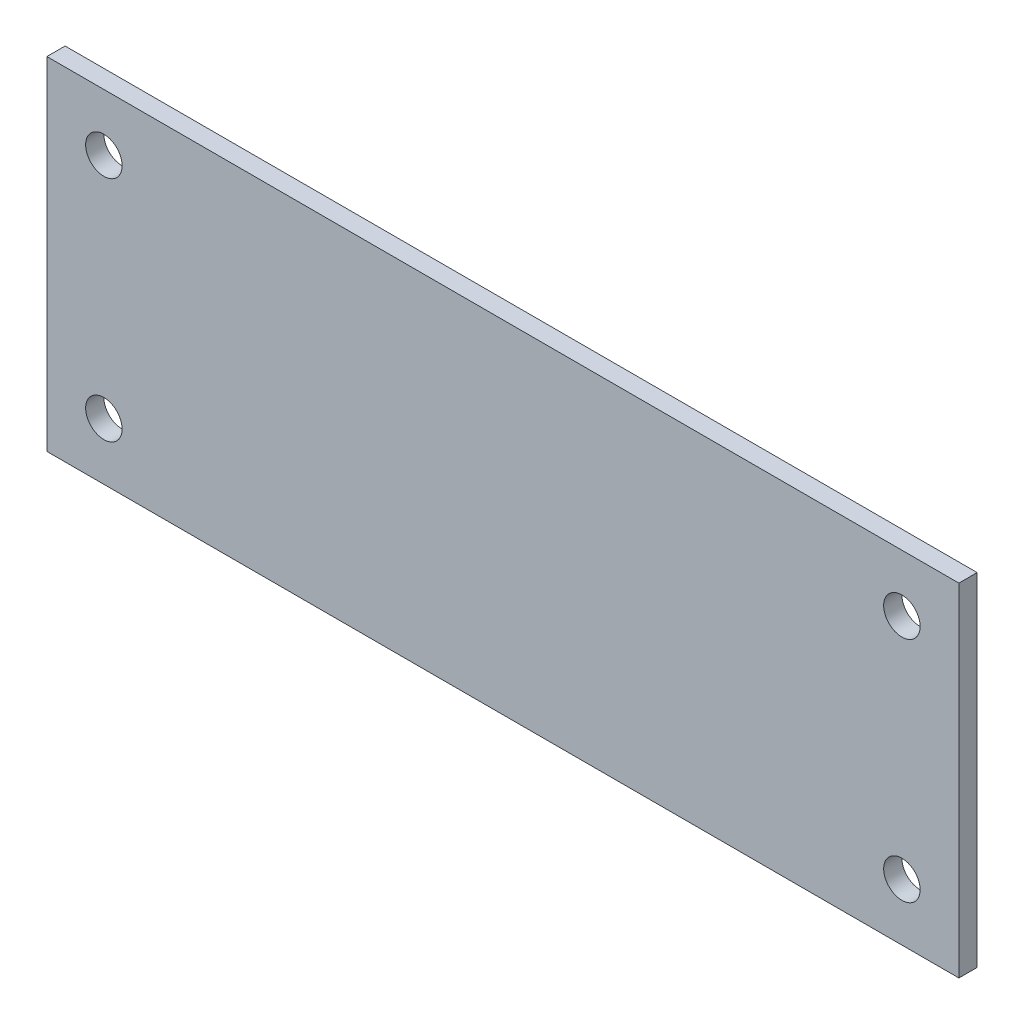
ISO-10303-21;
HEADER;
FILE_DESCRIPTION(('STEP AP214'),'2;1');
FILE_NAME('part.step','',(''),(''),'','','');
FILE_SCHEMA(('AUTOMOTIVE_DESIGN { 1 0 10303 214 1 1 1 1 }'));
ENDSEC;
DATA;
#1=APPLICATION_CONTEXT('core data for automotive mechanical design processes');
#2=APPLICATION_PROTOCOL_DEFINITION('international standard','automotive_design',2000,#1);
#3=PRODUCT_CONTEXT('',#1,'mechanical');
#4=PRODUCT('Part','Part','',(#3));
#5=PRODUCT_RELATED_PRODUCT_CATEGORY('part','',(#4));
#6=PRODUCT_DEFINITION_FORMATION('','',#4);
#7=PRODUCT_DEFINITION_CONTEXT('part definition',#1,'design');
#8=PRODUCT_DEFINITION('design','',#6,#7);
#9=PRODUCT_DEFINITION_SHAPE('','',#8);
#10=(LENGTH_UNIT() NAMED_UNIT(*) SI_UNIT(.MILLI.,.METRE.));
#11=(NAMED_UNIT(*) PLANE_ANGLE_UNIT() SI_UNIT($,.RADIAN.));
#12=(NAMED_UNIT(*) SI_UNIT($,.STERADIAN.) SOLID_ANGLE_UNIT());
#13=UNCERTAINTY_MEASURE_WITH_UNIT(LENGTH_MEASURE(1.E-05),#10,'distance_accuracy_value','');
#14=(GEOMETRIC_REPRESENTATION_CONTEXT(3) GLOBAL_UNCERTAINTY_ASSIGNED_CONTEXT((#13)) GLOBAL_UNIT_ASSIGNED_CONTEXT((#10,
#11,#12)) REPRESENTATION_CONTEXT('',''));
#15=CARTESIAN_POINT('',(0.,0.,0.));
#16=DIRECTION('',(0.,0.,1.));
#17=DIRECTION('',(1.,0.,0.));
#18=AXIS2_PLACEMENT_3D('',#15,#16,#17);
#19=CARTESIAN_POINT('',(0.,0.,1.6));
#20=DIRECTION('',(0.,0.,1.));
#21=DIRECTION('',(1.,0.,0.));
#22=AXIS2_PLACEMENT_3D('',#19,#20,#21);
#23=PLANE('',#22);
#24=CARTESIAN_POINT('',(35.,-10.,1.6));
#25=DIRECTION('',(0.,0.,1.));
#26=DIRECTION('',(1.,0.,0.));
#27=AXIS2_PLACEMENT_3D('',#24,#25,#26);
#28=CIRCLE('',#27,1.6);
#29=CARTESIAN_POINT('',(36.6,-10.,1.6));
#30=VERTEX_POINT('',#29);
#31=EDGE_CURVE('E121',#30,#30,#28,.T.);
#32=ORIENTED_EDGE('',*,*,#31,.F.);
#33=EDGE_LOOP('',(#32));
#34=FACE_BOUND('',#33,.T.);
#35=CARTESIAN_POINT('',(-35.,10.,1.6));
#36=DIRECTION('',(0.,0.,1.));
#37=DIRECTION('',(1.,0.,0.));
#38=AXIS2_PLACEMENT_3D('',#35,#36,#37);
#39=CIRCLE('',#38,1.6);
#40=CARTESIAN_POINT('',(-33.4,10.,1.6));
#41=VERTEX_POINT('',#40);
#42=EDGE_CURVE('E100',#41,#41,#39,.T.);
#43=ORIENTED_EDGE('',*,*,#42,.F.);
#44=EDGE_LOOP('',(#43));
#45=FACE_BOUND('',#44,.T.);
#46=DIRECTION('',(0.,-1.,0.));
#47=VECTOR('',#46,1.);
#48=CARTESIAN_POINT('',(-40.,15.,1.6));
#49=LINE('',#48,#47);
#50=CARTESIAN_POINT('',(-40.,15.,1.6));
#51=VERTEX_POINT('',#50);
#52=CARTESIAN_POINT('',(-40.,-15.,1.6));
#53=VERTEX_POINT('',#52);
#54=EDGE_CURVE('E85',#51,#53,#49,.T.);
#55=ORIENTED_EDGE('',*,*,#54,.T.);
#56=DIRECTION('',(1.,0.,0.));
#57=VECTOR('',#56,1.);
#58=CARTESIAN_POINT('',(-40.,-15.,1.6));
#59=LINE('',#58,#57);
#60=CARTESIAN_POINT('',(40.,-15.,1.6));
#61=VERTEX_POINT('',#60);
#62=EDGE_CURVE('E80',#53,#61,#59,.T.);
#63=ORIENTED_EDGE('',*,*,#62,.T.);
#64=DIRECTION('',(0.,1.,0.));
#65=VECTOR('',#64,1.);
#66=CARTESIAN_POINT('',(40.,15.,1.6));
#67=LINE('',#66,#65);
#68=CARTESIAN_POINT('',(40.,15.,1.6));
#69=VERTEX_POINT('',#68);
#70=EDGE_CURVE('E83',#61,#69,#67,.T.);
#71=ORIENTED_EDGE('',*,*,#70,.T.);
#72=DIRECTION('',(-1.,0.,0.));
#73=VECTOR('',#72,1.);
#74=CARTESIAN_POINT('',(-40.,15.,1.6));
#75=LINE('',#74,#73);
#76=EDGE_CURVE('E50',#69,#51,#75,.T.);
#77=ORIENTED_EDGE('',*,*,#76,.T.);
#78=EDGE_LOOP('',(#55,#63,#71,#77));
#79=FACE_BOUND('',#78,.T.);
#80=CARTESIAN_POINT('',(35.,10.,1.6));
#81=DIRECTION('',(0.,0.,1.));
#82=DIRECTION('',(1.,0.,0.));
#83=AXIS2_PLACEMENT_3D('',#80,#81,#82);
#84=CIRCLE('',#83,1.6);
#85=CARTESIAN_POINT('',(36.6,10.,1.6));
#86=VERTEX_POINT('',#85);
#87=EDGE_CURVE('E115',#86,#86,#84,.T.);
#88=ORIENTED_EDGE('',*,*,#87,.F.);
#89=EDGE_LOOP('',(#88));
#90=FACE_BOUND('',#89,.T.);
#91=CARTESIAN_POINT('',(-35.,-10.,1.6));
#92=DIRECTION('',(0.,0.,1.));
#93=DIRECTION('',(1.,0.,0.));
#94=AXIS2_PLACEMENT_3D('',#91,#92,#93);
#95=CIRCLE('',#94,1.6);
#96=CARTESIAN_POINT('',(-33.4,-10.,1.6));
#97=VERTEX_POINT('',#96);
#98=EDGE_CURVE('E127',#97,#97,#95,.T.);
#99=ORIENTED_EDGE('',*,*,#98,.F.);
#100=EDGE_LOOP('',(#99));
#101=FACE_BOUND('',#100,.T.);
#102=ADVANCED_FACE('F33',(#34,#45,#79,#90,#101),#23,.T.);
#103=CARTESIAN_POINT('',(0.,0.,0.));
#104=DIRECTION('',(0.,0.,1.));
#105=DIRECTION('',(1.,0.,0.));
#106=AXIS2_PLACEMENT_3D('',#103,#104,#105);
#107=PLANE('',#106);
#108=DIRECTION('',(0.,-1.,0.));
#109=VECTOR('',#108,1.);
#110=CARTESIAN_POINT('',(-40.,15.,0.));
#111=LINE('',#110,#109);
#112=CARTESIAN_POINT('',(-40.,15.,0.));
#113=VERTEX_POINT('',#112);
#114=CARTESIAN_POINT('',(-40.,-15.,0.));
#115=VERTEX_POINT('',#114);
#116=EDGE_CURVE('E97',#113,#115,#111,.T.);
#117=ORIENTED_EDGE('',*,*,#116,.F.);
#118=DIRECTION('',(-1.,0.,0.));
#119=VECTOR('',#118,1.);
#120=CARTESIAN_POINT('',(-40.,15.,0.));
#121=LINE('',#120,#119);
#122=CARTESIAN_POINT('',(40.,15.,0.));
#123=VERTEX_POINT('',#122);
#124=EDGE_CURVE('E73',#123,#113,#121,.T.);
#125=ORIENTED_EDGE('',*,*,#124,.F.);
#126=DIRECTION('',(0.,1.,0.));
#127=VECTOR('',#126,1.);
#128=CARTESIAN_POINT('',(40.,15.,0.));
#129=LINE('',#128,#127);
#130=CARTESIAN_POINT('',(40.,-15.,0.));
#131=VERTEX_POINT('',#130);
#132=EDGE_CURVE('E67',#131,#123,#129,.T.);
#133=ORIENTED_EDGE('',*,*,#132,.F.);
#134=DIRECTION('',(1.,0.,0.));
#135=VECTOR('',#134,1.);
#136=CARTESIAN_POINT('',(-40.,-15.,0.));
#137=LINE('',#136,#135);
#138=EDGE_CURVE('E89',#115,#131,#137,.T.);
#139=ORIENTED_EDGE('',*,*,#138,.F.);
#140=EDGE_LOOP('',(#117,#125,#133,#139));
#141=FACE_BOUND('',#140,.T.);
#142=CARTESIAN_POINT('',(-35.,10.,0.));
#143=DIRECTION('',(0.,0.,1.));
#144=DIRECTION('',(1.,0.,0.));
#145=AXIS2_PLACEMENT_3D('',#142,#143,#144);
#146=CIRCLE('',#145,1.6);
#147=CARTESIAN_POINT('',(-33.4,10.,0.));
#148=VERTEX_POINT('',#147);
#149=EDGE_CURVE('E112',#148,#148,#146,.T.);
#150=ORIENTED_EDGE('',*,*,#149,.T.);
#151=EDGE_LOOP('',(#150));
#152=FACE_BOUND('',#151,.T.);
#153=CARTESIAN_POINT('',(35.,10.,0.));
#154=DIRECTION('',(0.,0.,1.));
#155=DIRECTION('',(1.,0.,0.));
#156=AXIS2_PLACEMENT_3D('',#153,#154,#155);
#157=CIRCLE('',#156,1.6);
#158=CARTESIAN_POINT('',(36.6,10.,0.));
#159=VERTEX_POINT('',#158);
#160=EDGE_CURVE('E118',#159,#159,#157,.T.);
#161=ORIENTED_EDGE('',*,*,#160,.T.);
#162=EDGE_LOOP('',(#161));
#163=FACE_BOUND('',#162,.T.);
#164=CARTESIAN_POINT('',(35.,-10.,0.));
#165=DIRECTION('',(0.,0.,1.));
#166=DIRECTION('',(1.,0.,0.));
#167=AXIS2_PLACEMENT_3D('',#164,#165,#166);
#168=CIRCLE('',#167,1.6);
#169=CARTESIAN_POINT('',(36.6,-10.,0.));
#170=VERTEX_POINT('',#169);
#171=EDGE_CURVE('E124',#170,#170,#168,.T.);
#172=ORIENTED_EDGE('',*,*,#171,.T.);
#173=EDGE_LOOP('',(#172));
#174=FACE_BOUND('',#173,.T.);
#175=CARTESIAN_POINT('',(-35.,-10.,0.));
#176=DIRECTION('',(0.,0.,1.));
#177=DIRECTION('',(1.,0.,0.));
#178=AXIS2_PLACEMENT_3D('',#175,#176,#177);
#179=CIRCLE('',#178,1.6);
#180=CARTESIAN_POINT('',(-33.4,-10.,0.));
#181=VERTEX_POINT('',#180);
#182=EDGE_CURVE('E130',#181,#181,#179,.T.);
#183=ORIENTED_EDGE('',*,*,#182,.T.);
#184=EDGE_LOOP('',(#183));
#185=FACE_BOUND('',#184,.T.);
#186=ADVANCED_FACE('F108',(#141,#152,#163,#174,#185),#107,.F.);
#187=CARTESIAN_POINT('',(-40.,15.,1.6));
#188=DIRECTION('',(1.,0.,0.));
#189=DIRECTION('',(0.,0.,-1.));
#190=AXIS2_PLACEMENT_3D('',#187,#188,#189);
#191=PLANE('',#190);
#192=ORIENTED_EDGE('',*,*,#116,.T.);
#193=DIRECTION('',(0.,0.,-1.));
#194=VECTOR('',#193,1.);
#195=CARTESIAN_POINT('',(-40.,-15.,1.6));
#196=LINE('',#195,#194);
#197=EDGE_CURVE('E11',#53,#115,#196,.T.);
#198=ORIENTED_EDGE('',*,*,#197,.F.);
#199=ORIENTED_EDGE('',*,*,#54,.F.);
#200=DIRECTION('',(0.,0.,-1.));
#201=VECTOR('',#200,1.);
#202=CARTESIAN_POINT('',(-40.,15.,1.6));
#203=LINE('',#202,#201);
#204=EDGE_CURVE('E93',#51,#113,#203,.T.);
#205=ORIENTED_EDGE('',*,*,#204,.T.);
#206=EDGE_LOOP('',(#192,#198,#199,#205));
#207=FACE_BOUND('',#206,.T.);
#208=ADVANCED_FACE('F35',(#207),#191,.F.);
#209=CARTESIAN_POINT('',(-40.,-15.,1.6));
#210=DIRECTION('',(0.,1.,0.));
#211=DIRECTION('',(0.,0.,1.));
#212=AXIS2_PLACEMENT_3D('',#209,#210,#211);
#213=PLANE('',#212);
#214=ORIENTED_EDGE('',*,*,#138,.T.);
#215=DIRECTION('',(0.,0.,-1.));
#216=VECTOR('',#215,1.);
#217=CARTESIAN_POINT('',(40.,-15.,1.6));
#218=LINE('',#217,#216);
#219=EDGE_CURVE('E42',#61,#131,#218,.T.);
#220=ORIENTED_EDGE('',*,*,#219,.F.);
#221=ORIENTED_EDGE('',*,*,#62,.F.);
#222=ORIENTED_EDGE('',*,*,#197,.T.);
#223=EDGE_LOOP('',(#214,#220,#221,#222));
#224=FACE_BOUND('',#223,.T.);
#225=ADVANCED_FACE('F88',(#224),#213,.F.);
#226=CARTESIAN_POINT('',(40.,15.,1.6));
#227=DIRECTION('',(-1.,0.,0.));
#228=DIRECTION('',(0.,0.,1.));
#229=AXIS2_PLACEMENT_3D('',#226,#227,#228);
#230=PLANE('',#229);
#231=ORIENTED_EDGE('',*,*,#132,.T.);
#232=DIRECTION('',(0.,0.,-1.));
#233=VECTOR('',#232,1.);
#234=CARTESIAN_POINT('',(40.,15.,1.6));
#235=LINE('',#234,#233);
#236=EDGE_CURVE('E90',#69,#123,#235,.T.);
#237=ORIENTED_EDGE('',*,*,#236,.F.);
#238=ORIENTED_EDGE('',*,*,#70,.F.);
#239=ORIENTED_EDGE('',*,*,#219,.T.);
#240=EDGE_LOOP('',(#231,#237,#238,#239));
#241=FACE_BOUND('',#240,.T.);
#242=ADVANCED_FACE('F91',(#241),#230,.F.);
#243=CARTESIAN_POINT('',(-40.,15.,1.6));
#244=DIRECTION('',(0.,-1.,0.));
#245=DIRECTION('',(0.,0.,-1.));
#246=AXIS2_PLACEMENT_3D('',#243,#244,#245);
#247=PLANE('',#246);
#248=ORIENTED_EDGE('',*,*,#124,.T.);
#249=ORIENTED_EDGE('',*,*,#204,.F.);
#250=ORIENTED_EDGE('',*,*,#76,.F.);
#251=ORIENTED_EDGE('',*,*,#236,.T.);
#252=EDGE_LOOP('',(#248,#249,#250,#251));
#253=FACE_BOUND('',#252,.T.);
#254=ADVANCED_FACE('F105',(#253),#247,.F.);
#255=CARTESIAN_POINT('',(-35.,10.,1.6));
#256=DIRECTION('',(0.,0.,-1.));
#257=DIRECTION('',(-1.,0.,0.));
#258=AXIS2_PLACEMENT_3D('',#255,#256,#257);
#259=CYLINDRICAL_SURFACE('',#258,1.6);
#260=ORIENTED_EDGE('',*,*,#42,.T.);
#261=EDGE_LOOP('',(#260));
#262=FACE_BOUND('',#261,.T.);
#263=ORIENTED_EDGE('',*,*,#149,.F.);
#264=EDGE_LOOP('',(#263));
#265=FACE_BOUND('',#264,.T.);
#266=ADVANCED_FACE('F149',(#262,#265),#259,.F.);
#267=CARTESIAN_POINT('',(35.,10.,1.6));
#268=DIRECTION('',(0.,0.,-1.));
#269=DIRECTION('',(-1.,0.,0.));
#270=AXIS2_PLACEMENT_3D('',#267,#268,#269);
#271=CYLINDRICAL_SURFACE('',#270,1.6);
#272=ORIENTED_EDGE('',*,*,#87,.T.);
#273=EDGE_LOOP('',(#272));
#274=FACE_BOUND('',#273,.T.);
#275=ORIENTED_EDGE('',*,*,#160,.F.);
#276=EDGE_LOOP('',(#275));
#277=FACE_BOUND('',#276,.T.);
#278=ADVANCED_FACE('F195',(#274,#277),#271,.F.);
#279=CARTESIAN_POINT('',(35.,-10.,1.6));
#280=DIRECTION('',(0.,0.,-1.));
#281=DIRECTION('',(-1.,0.,0.));
#282=AXIS2_PLACEMENT_3D('',#279,#280,#281);
#283=CYLINDRICAL_SURFACE('',#282,1.6);
#284=ORIENTED_EDGE('',*,*,#31,.T.);
#285=EDGE_LOOP('',(#284));
#286=FACE_BOUND('',#285,.T.);
#287=ORIENTED_EDGE('',*,*,#171,.F.);
#288=EDGE_LOOP('',(#287));
#289=FACE_BOUND('',#288,.T.);
#290=ADVANCED_FACE('F203',(#286,#289),#283,.F.);
#291=CARTESIAN_POINT('',(-35.,-10.,1.6));
#292=DIRECTION('',(0.,0.,-1.));
#293=DIRECTION('',(-1.,0.,0.));
#294=AXIS2_PLACEMENT_3D('',#291,#292,#293);
#295=CYLINDRICAL_SURFACE('',#294,1.6);
#296=ORIENTED_EDGE('',*,*,#98,.T.);
#297=EDGE_LOOP('',(#296));
#298=FACE_BOUND('',#297,.T.);
#299=ORIENTED_EDGE('',*,*,#182,.F.);
#300=EDGE_LOOP('',(#299));
#301=FACE_BOUND('',#300,.T.);
#302=ADVANCED_FACE('F136',(#298,#301),#295,.F.);
#303=CLOSED_SHELL('',(#102,#186,#208,#225,#242,#254,#266,#278,#290,#302));
#304=MANIFOLD_SOLID_BREP('B2',#303);
#305=ADVANCED_BREP_SHAPE_REPRESENTATION('',(#18,#304),#14);
#306=SHAPE_DEFINITION_REPRESENTATION(#9,#305);
ENDSEC;
END-ISO-10303-21;
